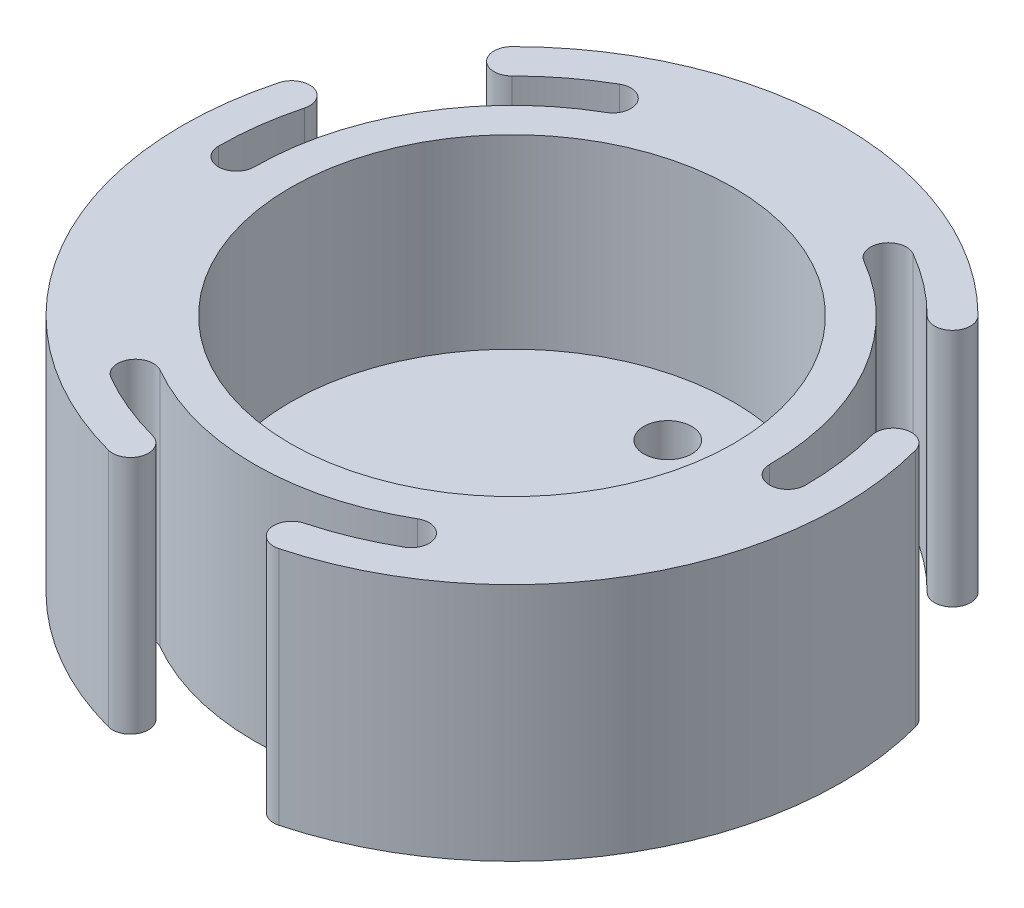
ISO-10303-21;
HEADER;
FILE_DESCRIPTION(('STEP AP214'),'2;1');
FILE_NAME('part.step','',(''),(''),'','','');
FILE_SCHEMA(('AUTOMOTIVE_DESIGN { 1 0 10303 214 1 1 1 1 }'));
ENDSEC;
DATA;
#1=APPLICATION_CONTEXT('core data for automotive mechanical design processes');
#2=APPLICATION_PROTOCOL_DEFINITION('international standard','automotive_design',2000,#1);
#3=PRODUCT_CONTEXT('',#1,'mechanical');
#4=PRODUCT('Part','Part','',(#3));
#5=PRODUCT_RELATED_PRODUCT_CATEGORY('part','',(#4));
#6=PRODUCT_DEFINITION_FORMATION('','',#4);
#7=PRODUCT_DEFINITION_CONTEXT('part definition',#1,'design');
#8=PRODUCT_DEFINITION('design','',#6,#7);
#9=PRODUCT_DEFINITION_SHAPE('','',#8);
#10=(LENGTH_UNIT() NAMED_UNIT(*) SI_UNIT(.MILLI.,.METRE.));
#11=(NAMED_UNIT(*) PLANE_ANGLE_UNIT() SI_UNIT($,.RADIAN.));
#12=(NAMED_UNIT(*) SI_UNIT($,.STERADIAN.) SOLID_ANGLE_UNIT());
#13=UNCERTAINTY_MEASURE_WITH_UNIT(LENGTH_MEASURE(1.E-05),#10,'distance_accuracy_value','');
#14=(GEOMETRIC_REPRESENTATION_CONTEXT(3) GLOBAL_UNCERTAINTY_ASSIGNED_CONTEXT((#13)) GLOBAL_UNIT_ASSIGNED_CONTEXT((#10,
#11,#12)) REPRESENTATION_CONTEXT('',''));
#15=CARTESIAN_POINT('',(0.,0.,0.));
#16=DIRECTION('',(0.,0.,1.));
#17=DIRECTION('',(1.,0.,0.));
#18=AXIS2_PLACEMENT_3D('',#15,#16,#17);
#19=CARTESIAN_POINT('',(0.,20.,0.));
#20=DIRECTION('',(0.,-1.,0.));
#21=DIRECTION('',(0.,0.,-1.));
#22=AXIS2_PLACEMENT_3D('',#19,#20,#21);
#23=CYLINDRICAL_SURFACE('',#22,18.5);
#24=CARTESIAN_POINT('',(0.,20.,0.));
#25=DIRECTION('',(0.,1.,0.));
#26=DIRECTION('',(0.,0.,1.));
#27=AXIS2_PLACEMENT_3D('',#24,#25,#26);
#28=CIRCLE('',#27,18.5);
#29=CARTESIAN_POINT('',(0.,20.,18.5));
#30=VERTEX_POINT('',#29);
#31=EDGE_CURVE('E11',#30,#30,#28,.T.);
#32=ORIENTED_EDGE('',*,*,#31,.T.);
#33=EDGE_LOOP('',(#32));
#34=FACE_BOUND('',#33,.T.);
#35=CARTESIAN_POINT('',(0.,4.5,0.));
#36=DIRECTION('',(0.,-1.,0.));
#37=DIRECTION('',(0.,0.,-1.));
#38=AXIS2_PLACEMENT_3D('',#35,#36,#37);
#39=CIRCLE('',#38,18.5);
#40=CARTESIAN_POINT('',(0.,4.5,-18.5));
#41=VERTEX_POINT('',#40);
#42=EDGE_CURVE('E284',#41,#41,#39,.T.);
#43=ORIENTED_EDGE('',*,*,#42,.T.);
#44=EDGE_LOOP('',(#43));
#45=FACE_BOUND('',#44,.T.);
#46=ADVANCED_FACE('F37',(#34,#45),#23,.F.);
#47=CARTESIAN_POINT('',(0.,20.,0.));
#48=DIRECTION('',(0.,1.,0.));
#49=DIRECTION('',(0.,0.,1.));
#50=AXIS2_PLACEMENT_3D('',#47,#48,#49);
#51=PLANE('',#50);
#52=CARTESIAN_POINT('',(-11.5000000000001,20.,19.918584287042));
#53=DIRECTION('',(0.,1.,0.));
#54=DIRECTION('',(0.,0.,1.));
#55=AXIS2_PLACEMENT_3D('',#52,#53,#54);
#56=CIRCLE('',#55,1.5);
#57=CARTESIAN_POINT('',(-10.7500000000001,20.,18.6195461813654));
#58=VERTEX_POINT('',#57);
#59=CARTESIAN_POINT('',(-12.2500000000001,20.,21.2176223927187));
#60=VERTEX_POINT('',#59);
#61=EDGE_CURVE('E129',#58,#60,#56,.T.);
#62=ORIENTED_EDGE('',*,*,#61,.F.);
#63=CARTESIAN_POINT('',(0.,20.,0.));
#64=DIRECTION('',(0.,-1.,0.));
#65=DIRECTION('',(0.,0.,1.));
#66=AXIS2_PLACEMENT_3D('',#63,#64,#65);
#67=CIRCLE('',#66,21.5);
#68=CARTESIAN_POINT('',(10.7499999999998,20.,18.6195461813655));
#69=VERTEX_POINT('',#68);
#70=EDGE_CURVE('E121',#69,#58,#67,.T.);
#71=ORIENTED_EDGE('',*,*,#70,.F.);
#72=CARTESIAN_POINT('',(11.4999999999998,20.,19.9185842870422));
#73=DIRECTION('',(0.,1.,0.));
#74=DIRECTION('',(0.,0.,1.));
#75=AXIS2_PLACEMENT_3D('',#72,#73,#74);
#76=CIRCLE('',#75,1.5);
#77=CARTESIAN_POINT('',(12.2499999999998,20.,21.2176223927189));
#78=VERTEX_POINT('',#77);
#79=EDGE_CURVE('E133',#78,#69,#76,.T.);
#80=ORIENTED_EDGE('',*,*,#79,.F.);
#81=CARTESIAN_POINT('',(0.,20.,0.));
#82=DIRECTION('',(0.,-1.,0.));
#83=DIRECTION('',(0.,0.,1.));
#84=AXIS2_PLACEMENT_3D('',#81,#82,#83);
#85=CIRCLE('',#84,24.5);
#86=CARTESIAN_POINT('',(6.34106660501176,20.,23.6651827440822));
#87=VERTEX_POINT('',#86);
#88=EDGE_CURVE('E233',#78,#87,#85,.T.);
#89=ORIENTED_EDGE('',*,*,#88,.T.);
#90=CARTESIAN_POINT('',(6.7292951726655,20.,25.1140714835158));
#91=DIRECTION('',(0.,1.,0.));
#92=DIRECTION('',(0.,0.,1.));
#93=AXIS2_PLACEMENT_3D('',#90,#91,#92);
#94=CIRCLE('',#93,1.5);
#95=CARTESIAN_POINT('',(7.11752374031928,20.,26.5629602229494));
#96=VERTEX_POINT('',#95);
#97=EDGE_CURVE('E201',#87,#96,#94,.T.);
#98=ORIENTED_EDGE('',*,*,#97,.T.);
#99=CARTESIAN_POINT('',(0.,20.,0.));
#100=DIRECTION('',(0.,1.,0.));
#101=DIRECTION('',(0.,0.,1.));
#102=AXIS2_PLACEMENT_3D('',#99,#100,#101);
#103=CIRCLE('',#102,27.5);
#104=CARTESIAN_POINT('',(26.5629602229494,20.,-7.11752374031937));
#105=VERTEX_POINT('',#104);
#106=EDGE_CURVE('E224',#96,#105,#103,.T.);
#107=ORIENTED_EDGE('',*,*,#106,.T.);
#108=CARTESIAN_POINT('',(25.1140714835158,20.,-6.72929517266559));
#109=DIRECTION('',(0.,1.,0.));
#110=DIRECTION('',(0.,0.,1.));
#111=AXIS2_PLACEMENT_3D('',#108,#109,#110);
#112=CIRCLE('',#111,1.5);
#113=CARTESIAN_POINT('',(23.6651827440822,20.,-6.34106660501185));
#114=VERTEX_POINT('',#113);
#115=EDGE_CURVE('E227',#105,#114,#112,.T.);
#116=ORIENTED_EDGE('',*,*,#115,.T.);
#117=CARTESIAN_POINT('',(24.5,20.,1.33219235306974E-13));
#118=VERTEX_POINT('',#117);
#119=EDGE_CURVE('E230',#114,#118,#85,.T.);
#120=ORIENTED_EDGE('',*,*,#119,.T.);
#121=CARTESIAN_POINT('',(23.,20.,1.25062955594302E-13));
#122=DIRECTION('',(0.,1.,0.));
#123=DIRECTION('',(0.,0.,1.));
#124=AXIS2_PLACEMENT_3D('',#121,#122,#123);
#125=CIRCLE('',#124,1.5);
#126=CARTESIAN_POINT('',(21.5,20.,1.158915114504E-13));
#127=VERTEX_POINT('',#126);
#128=EDGE_CURVE('E98',#127,#118,#125,.T.);
#129=ORIENTED_EDGE('',*,*,#128,.F.);
#130=CARTESIAN_POINT('',(0.,20.,0.));
#131=DIRECTION('',(0.,-1.,0.));
#132=DIRECTION('',(0.,0.,1.));
#133=AXIS2_PLACEMENT_3D('',#130,#131,#132);
#134=CIRCLE('',#133,21.5);
#135=CARTESIAN_POINT('',(10.7500000000002,20.,-18.6195461813653));
#136=VERTEX_POINT('',#135);
#137=EDGE_CURVE('E153',#136,#127,#134,.T.);
#138=ORIENTED_EDGE('',*,*,#137,.F.);
#139=CARTESIAN_POINT('',(11.5000000000002,20.,-19.918584287042));
#140=DIRECTION('',(0.,1.,0.));
#141=DIRECTION('',(0.,0.,1.));
#142=AXIS2_PLACEMENT_3D('',#139,#140,#141);
#143=CIRCLE('',#142,1.5);
#144=CARTESIAN_POINT('',(12.2500000000002,20.,-21.2176223927186));
#145=VERTEX_POINT('',#144);
#146=EDGE_CURVE('E102',#145,#136,#143,.T.);
#147=ORIENTED_EDGE('',*,*,#146,.F.);
#148=CARTESIAN_POINT('',(0.,20.,0.));
#149=DIRECTION('',(0.,-1.,0.));
#150=DIRECTION('',(0.,0.,1.));
#151=AXIS2_PLACEMENT_3D('',#148,#149,#150);
#152=CIRCLE('',#151,24.5);
#153=CARTESIAN_POINT('',(17.3241161390705,20.,-17.3241161390704));
#154=VERTEX_POINT('',#153);
#155=EDGE_CURVE('E192',#145,#154,#152,.T.);
#156=ORIENTED_EDGE('',*,*,#155,.T.);
#157=CARTESIAN_POINT('',(18.3847763108503,20.,-18.3847763108502));
#158=DIRECTION('',(0.,1.,0.));
#159=DIRECTION('',(0.,0.,1.));
#160=AXIS2_PLACEMENT_3D('',#157,#158,#159);
#161=CIRCLE('',#160,1.5);
#162=CARTESIAN_POINT('',(19.4454364826301,20.,-19.44543648263));
#163=VERTEX_POINT('',#162);
#164=EDGE_CURVE('E198',#154,#163,#161,.T.);
#165=ORIENTED_EDGE('',*,*,#164,.T.);
#166=CARTESIAN_POINT('',(0.,20.,0.));
#167=DIRECTION('',(0.,1.,0.));
#168=DIRECTION('',(0.,0.,1.));
#169=AXIS2_PLACEMENT_3D('',#166,#167,#168);
#170=CIRCLE('',#169,27.5);
#171=CARTESIAN_POINT('',(-19.4454364826301,20.,-19.44543648263));
#172=VERTEX_POINT('',#171);
#173=EDGE_CURVE('E195',#163,#172,#170,.T.);
#174=ORIENTED_EDGE('',*,*,#173,.T.);
#175=CARTESIAN_POINT('',(-18.3847763108503,20.,-18.3847763108502));
#176=DIRECTION('',(0.,1.,0.));
#177=DIRECTION('',(0.,0.,1.));
#178=AXIS2_PLACEMENT_3D('',#175,#176,#177);
#179=CIRCLE('',#178,1.5);
#180=CARTESIAN_POINT('',(-17.3241161390705,20.,-17.3241161390704));
#181=VERTEX_POINT('',#180);
#182=EDGE_CURVE('E193',#172,#181,#179,.T.);
#183=ORIENTED_EDGE('',*,*,#182,.T.);
#184=CARTESIAN_POINT('',(-12.2499999999999,20.,-21.2176223927188));
#185=VERTEX_POINT('',#184);
#186=EDGE_CURVE('E97',#181,#185,#152,.T.);
#187=ORIENTED_EDGE('',*,*,#186,.T.);
#188=CARTESIAN_POINT('',(-11.4999999999999,20.,-19.9185842870422));
#189=DIRECTION('',(0.,1.,0.));
#190=DIRECTION('',(0.,0.,1.));
#191=AXIS2_PLACEMENT_3D('',#188,#189,#190);
#192=CIRCLE('',#191,1.5);
#193=CARTESIAN_POINT('',(-10.7499999999999,20.,-18.6195461813655));
#194=VERTEX_POINT('',#193);
#195=EDGE_CURVE('E77',#194,#185,#192,.T.);
#196=ORIENTED_EDGE('',*,*,#195,.F.);
#197=CARTESIAN_POINT('',(0.,20.,0.));
#198=DIRECTION('',(0.,-1.,0.));
#199=DIRECTION('',(0.,0.,1.));
#200=AXIS2_PLACEMENT_3D('',#197,#198,#199);
#201=CIRCLE('',#200,21.5);
#202=CARTESIAN_POINT('',(-21.5,20.,-2.06291908745145E-13));
#203=VERTEX_POINT('',#202);
#204=EDGE_CURVE('E84',#203,#194,#201,.T.);
#205=ORIENTED_EDGE('',*,*,#204,.F.);
#206=CARTESIAN_POINT('',(-23.,20.,-2.21038701180133E-13));
#207=DIRECTION('',(0.,1.,0.));
#208=DIRECTION('',(0.,0.,1.));
#209=AXIS2_PLACEMENT_3D('',#206,#207,#208);
#210=CIRCLE('',#209,1.5);
#211=CARTESIAN_POINT('',(-24.5,20.,-2.65625032378703E-13));
#212=VERTEX_POINT('',#211);
#213=EDGE_CURVE('E89',#212,#203,#210,.T.);
#214=ORIENTED_EDGE('',*,*,#213,.F.);
#215=CARTESIAN_POINT('',(0.,20.,0.));
#216=DIRECTION('',(0.,-1.,0.));
#217=DIRECTION('',(0.,0.,1.));
#218=AXIS2_PLACEMENT_3D('',#215,#216,#217);
#219=CIRCLE('',#218,24.5);
#220=CARTESIAN_POINT('',(-23.6651827440822,20.,-6.34106660501178));
#221=VERTEX_POINT('',#220);
#222=EDGE_CURVE('E270',#212,#221,#219,.T.);
#223=ORIENTED_EDGE('',*,*,#222,.T.);
#224=CARTESIAN_POINT('',(-25.1140714835158,20.,-6.72929517266559));
#225=DIRECTION('',(0.,1.,0.));
#226=DIRECTION('',(0.,0.,1.));
#227=AXIS2_PLACEMENT_3D('',#224,#225,#226);
#228=CIRCLE('',#227,1.5);
#229=CARTESIAN_POINT('',(-26.5629602229494,20.,-7.11752374031937));
#230=VERTEX_POINT('',#229);
#231=EDGE_CURVE('E247',#221,#230,#228,.T.);
#232=ORIENTED_EDGE('',*,*,#231,.T.);
#233=CARTESIAN_POINT('',(0.,20.,0.));
#234=DIRECTION('',(0.,1.,0.));
#235=DIRECTION('',(0.,0.,1.));
#236=AXIS2_PLACEMENT_3D('',#233,#234,#235);
#237=CIRCLE('',#236,27.5);
#238=CARTESIAN_POINT('',(-7.11752374031927,20.,26.5629602229494));
#239=VERTEX_POINT('',#238);
#240=EDGE_CURVE('E261',#230,#239,#237,.T.);
#241=ORIENTED_EDGE('',*,*,#240,.T.);
#242=CARTESIAN_POINT('',(-6.7292951726655,20.,25.1140714835158));
#243=DIRECTION('',(0.,1.,0.));
#244=DIRECTION('',(0.,0.,1.));
#245=AXIS2_PLACEMENT_3D('',#242,#243,#244);
#246=CIRCLE('',#245,1.5);
#247=CARTESIAN_POINT('',(-6.34106660501165,20.,23.6651827440822));
#248=VERTEX_POINT('',#247);
#249=EDGE_CURVE('E264',#239,#248,#246,.T.);
#250=ORIENTED_EDGE('',*,*,#249,.T.);
#251=EDGE_CURVE('E267',#248,#60,#219,.T.);
#252=ORIENTED_EDGE('',*,*,#251,.T.);
#253=EDGE_LOOP('',(#62,#71,#80,#89,#98,#107,#116,#120,#129,#138,#147,#156,#165,#174,#183,#187,
#196,#205,#214,#223,#232,#241,#250,#252));
#254=FACE_BOUND('',#253,.T.);
#255=ORIENTED_EDGE('',*,*,#31,.F.);
#256=EDGE_LOOP('',(#255));
#257=FACE_BOUND('',#256,.T.);
#258=ADVANCED_FACE('F93',(#254,#257),#51,.T.);
#259=CARTESIAN_POINT('',(0.,0.,0.));
#260=DIRECTION('',(0.,1.,0.));
#261=DIRECTION('',(0.,0.,1.));
#262=AXIS2_PLACEMENT_3D('',#259,#260,#261);
#263=PLANE('',#262);
#264=CARTESIAN_POINT('',(0.,0.,-13.));
#265=DIRECTION('',(0.,1.,0.));
#266=DIRECTION('',(0.,0.,1.));
#267=AXIS2_PLACEMENT_3D('',#264,#265,#266);
#268=CIRCLE('',#267,2.);
#269=CARTESIAN_POINT('',(0.,0.,-11.));
#270=VERTEX_POINT('',#269);
#271=EDGE_CURVE('E287',#270,#270,#268,.F.);
#272=ORIENTED_EDGE('',*,*,#271,.F.);
#273=EDGE_LOOP('',(#272));
#274=FACE_BOUND('',#273,.T.);
#275=CARTESIAN_POINT('',(11.2583302491977,0.,6.5));
#276=DIRECTION('',(0.,1.,0.));
#277=DIRECTION('',(0.,0.,1.));
#278=AXIS2_PLACEMENT_3D('',#275,#276,#277);
#279=CIRCLE('',#278,2.);
#280=CARTESIAN_POINT('',(11.2583302491977,0.,8.5));
#281=VERTEX_POINT('',#280);
#282=EDGE_CURVE('E291',#281,#281,#279,.F.);
#283=ORIENTED_EDGE('',*,*,#282,.F.);
#284=EDGE_LOOP('',(#283));
#285=FACE_BOUND('',#284,.T.);
#286=CARTESIAN_POINT('',(-11.2583302491977,0.,6.50000000000001));
#287=DIRECTION('',(0.,1.,0.));
#288=DIRECTION('',(0.,0.,1.));
#289=AXIS2_PLACEMENT_3D('',#286,#287,#288);
#290=CIRCLE('',#289,2.);
#291=CARTESIAN_POINT('',(-11.2583302491977,0.,8.5));
#292=VERTEX_POINT('',#291);
#293=EDGE_CURVE('E292',#292,#292,#290,.F.);
#294=ORIENTED_EDGE('',*,*,#293,.F.);
#295=EDGE_LOOP('',(#294));
#296=FACE_BOUND('',#295,.T.);
#297=CARTESIAN_POINT('',(-23.,0.,-2.21038701180133E-13));
#298=DIRECTION('',(0.,1.,0.));
#299=DIRECTION('',(0.,0.,1.));
#300=AXIS2_PLACEMENT_3D('',#297,#298,#299);
#301=CIRCLE('',#300,1.5);
#302=CARTESIAN_POINT('',(-24.5,0.,-2.35454268648402E-13));
#303=VERTEX_POINT('',#302);
#304=CARTESIAN_POINT('',(-21.5,0.,-2.06291908745145E-13));
#305=VERTEX_POINT('',#304);
#306=EDGE_CURVE('E52',#303,#305,#301,.T.);
#307=ORIENTED_EDGE('',*,*,#306,.T.);
#308=CARTESIAN_POINT('',(0.,0.,0.));
#309=DIRECTION('',(0.,-1.,0.));
#310=DIRECTION('',(0.,0.,1.));
#311=AXIS2_PLACEMENT_3D('',#308,#309,#310);
#312=CIRCLE('',#311,21.5);
#313=CARTESIAN_POINT('',(-10.7499999999999,0.,-18.6195461813655));
#314=VERTEX_POINT('',#313);
#315=EDGE_CURVE('E105',#305,#314,#312,.T.);
#316=ORIENTED_EDGE('',*,*,#315,.T.);
#317=CARTESIAN_POINT('',(-11.4999999999999,0.,-19.9185842870422));
#318=DIRECTION('',(0.,1.,0.));
#319=DIRECTION('',(0.,0.,1.));
#320=AXIS2_PLACEMENT_3D('',#317,#318,#319);
#321=CIRCLE('',#320,1.5);
#322=CARTESIAN_POINT('',(-12.2499999999999,0.,-21.2176223927188));
#323=VERTEX_POINT('',#322);
#324=EDGE_CURVE('E79',#314,#323,#321,.T.);
#325=ORIENTED_EDGE('',*,*,#324,.T.);
#326=CARTESIAN_POINT('',(0.,0.,0.));
#327=DIRECTION('',(0.,1.,0.));
#328=DIRECTION('',(0.,0.,1.));
#329=AXIS2_PLACEMENT_3D('',#326,#327,#328);
#330=CIRCLE('',#329,24.5);
#331=CARTESIAN_POINT('',(-17.3241161390705,0.,-17.3241161390704));
#332=VERTEX_POINT('',#331);
#333=EDGE_CURVE('E207',#323,#332,#330,.T.);
#334=ORIENTED_EDGE('',*,*,#333,.T.);
#335=CARTESIAN_POINT('',(-18.3847763108503,0.,-18.3847763108502));
#336=DIRECTION('',(0.,1.,0.));
#337=DIRECTION('',(0.,0.,1.));
#338=AXIS2_PLACEMENT_3D('',#335,#336,#337);
#339=CIRCLE('',#338,1.5);
#340=CARTESIAN_POINT('',(-19.4454364826301,0.,-19.44543648263));
#341=VERTEX_POINT('',#340);
#342=EDGE_CURVE('E190',#332,#341,#339,.F.);
#343=ORIENTED_EDGE('',*,*,#342,.T.);
#344=CARTESIAN_POINT('',(0.,0.,0.));
#345=DIRECTION('',(0.,1.,0.));
#346=DIRECTION('',(0.,0.,1.));
#347=AXIS2_PLACEMENT_3D('',#344,#345,#346);
#348=CIRCLE('',#347,27.5);
#349=CARTESIAN_POINT('',(19.4454364826301,0.,-19.44543648263));
#350=VERTEX_POINT('',#349);
#351=EDGE_CURVE('E142',#341,#350,#348,.F.);
#352=ORIENTED_EDGE('',*,*,#351,.T.);
#353=CARTESIAN_POINT('',(18.3847763108503,0.,-18.3847763108502));
#354=DIRECTION('',(0.,1.,0.));
#355=DIRECTION('',(0.,0.,1.));
#356=AXIS2_PLACEMENT_3D('',#353,#354,#355);
#357=CIRCLE('',#356,1.5);
#358=CARTESIAN_POINT('',(17.3241161390705,0.,-17.3241161390704));
#359=VERTEX_POINT('',#358);
#360=EDGE_CURVE('E177',#350,#359,#357,.F.);
#361=ORIENTED_EDGE('',*,*,#360,.T.);
#362=CARTESIAN_POINT('',(12.2500000000002,0.,-21.2176223927186));
#363=VERTEX_POINT('',#362);
#364=EDGE_CURVE('E204',#359,#363,#330,.T.);
#365=ORIENTED_EDGE('',*,*,#364,.T.);
#366=CARTESIAN_POINT('',(11.5000000000002,0.,-19.918584287042));
#367=DIRECTION('',(0.,1.,0.));
#368=DIRECTION('',(0.,0.,1.));
#369=AXIS2_PLACEMENT_3D('',#366,#367,#368);
#370=CIRCLE('',#369,1.5);
#371=CARTESIAN_POINT('',(10.7500000000002,0.,-18.6195461813653));
#372=VERTEX_POINT('',#371);
#373=EDGE_CURVE('E154',#363,#372,#370,.T.);
#374=ORIENTED_EDGE('',*,*,#373,.T.);
#375=CARTESIAN_POINT('',(0.,0.,0.));
#376=DIRECTION('',(0.,-1.,0.));
#377=DIRECTION('',(0.,0.,1.));
#378=AXIS2_PLACEMENT_3D('',#375,#376,#377);
#379=CIRCLE('',#378,21.5);
#380=CARTESIAN_POINT('',(21.5,0.,1.158915114504E-13));
#381=VERTEX_POINT('',#380);
#382=EDGE_CURVE('E157',#372,#381,#379,.T.);
#383=ORIENTED_EDGE('',*,*,#382,.T.);
#384=CARTESIAN_POINT('',(23.,0.,1.25062955594302E-13));
#385=DIRECTION('',(0.,1.,0.));
#386=DIRECTION('',(0.,0.,1.));
#387=AXIS2_PLACEMENT_3D('',#384,#385,#386);
#388=CIRCLE('',#387,1.5);
#389=CARTESIAN_POINT('',(24.5,0.,1.33219235306974E-13));
#390=VERTEX_POINT('',#389);
#391=EDGE_CURVE('E150',#381,#390,#388,.T.);
#392=ORIENTED_EDGE('',*,*,#391,.T.);
#393=CARTESIAN_POINT('',(0.,0.,0.));
#394=DIRECTION('',(0.,1.,0.));
#395=DIRECTION('',(0.,0.,1.));
#396=AXIS2_PLACEMENT_3D('',#393,#394,#395);
#397=CIRCLE('',#396,24.5);
#398=CARTESIAN_POINT('',(23.6651827440822,0.,-6.34106660501185));
#399=VERTEX_POINT('',#398);
#400=EDGE_CURVE('E217',#390,#399,#397,.T.);
#401=ORIENTED_EDGE('',*,*,#400,.T.);
#402=CARTESIAN_POINT('',(25.1140714835158,0.,-6.72929517266559));
#403=DIRECTION('',(0.,1.,0.));
#404=DIRECTION('',(0.,0.,1.));
#405=AXIS2_PLACEMENT_3D('',#402,#403,#404);
#406=CIRCLE('',#405,1.5);
#407=CARTESIAN_POINT('',(26.5629602229494,0.,-7.11752374031937));
#408=VERTEX_POINT('',#407);
#409=EDGE_CURVE('E210',#399,#408,#406,.F.);
#410=ORIENTED_EDGE('',*,*,#409,.T.);
#411=CARTESIAN_POINT('',(0.,0.,0.));
#412=DIRECTION('',(0.,1.,0.));
#413=DIRECTION('',(0.,0.,1.));
#414=AXIS2_PLACEMENT_3D('',#411,#412,#413);
#415=CIRCLE('',#414,27.5);
#416=CARTESIAN_POINT('',(7.11752374031928,0.,26.5629602229494));
#417=VERTEX_POINT('',#416);
#418=EDGE_CURVE('E221',#408,#417,#415,.F.);
#419=ORIENTED_EDGE('',*,*,#418,.T.);
#420=CARTESIAN_POINT('',(6.7292951726655,0.,25.1140714835158));
#421=DIRECTION('',(0.,1.,0.));
#422=DIRECTION('',(0.,0.,1.));
#423=AXIS2_PLACEMENT_3D('',#420,#421,#422);
#424=CIRCLE('',#423,1.5);
#425=CARTESIAN_POINT('',(6.34106660501176,0.,23.6651827440822));
#426=VERTEX_POINT('',#425);
#427=EDGE_CURVE('E218',#417,#426,#424,.F.);
#428=ORIENTED_EDGE('',*,*,#427,.T.);
#429=CARTESIAN_POINT('',(12.2499999999998,0.,21.2176223927189));
#430=VERTEX_POINT('',#429);
#431=EDGE_CURVE('E214',#426,#430,#397,.T.);
#432=ORIENTED_EDGE('',*,*,#431,.T.);
#433=CARTESIAN_POINT('',(11.4999999999998,0.,19.9185842870422));
#434=DIRECTION('',(0.,1.,0.));
#435=DIRECTION('',(0.,0.,1.));
#436=AXIS2_PLACEMENT_3D('',#433,#434,#435);
#437=CIRCLE('',#436,1.5);
#438=CARTESIAN_POINT('',(10.7499999999998,0.,18.6195461813655));
#439=VERTEX_POINT('',#438);
#440=EDGE_CURVE('E122',#430,#439,#437,.T.);
#441=ORIENTED_EDGE('',*,*,#440,.T.);
#442=CARTESIAN_POINT('',(0.,0.,0.));
#443=DIRECTION('',(0.,-1.,0.));
#444=DIRECTION('',(0.,0.,1.));
#445=AXIS2_PLACEMENT_3D('',#442,#443,#444);
#446=CIRCLE('',#445,21.5);
#447=CARTESIAN_POINT('',(-10.7500000000001,0.,18.6195461813654));
#448=VERTEX_POINT('',#447);
#449=EDGE_CURVE('E125',#439,#448,#446,.T.);
#450=ORIENTED_EDGE('',*,*,#449,.T.);
#451=CARTESIAN_POINT('',(-11.5000000000001,0.,19.918584287042));
#452=DIRECTION('',(0.,1.,0.));
#453=DIRECTION('',(0.,0.,1.));
#454=AXIS2_PLACEMENT_3D('',#451,#452,#453);
#455=CIRCLE('',#454,1.5);
#456=CARTESIAN_POINT('',(-12.2500000000001,0.,21.2176223927187));
#457=VERTEX_POINT('',#456);
#458=EDGE_CURVE('E118',#448,#457,#455,.T.);
#459=ORIENTED_EDGE('',*,*,#458,.T.);
#460=CARTESIAN_POINT('',(0.,0.,0.));
#461=DIRECTION('',(0.,1.,0.));
#462=DIRECTION('',(0.,0.,1.));
#463=AXIS2_PLACEMENT_3D('',#460,#461,#462);
#464=CIRCLE('',#463,24.5);
#465=CARTESIAN_POINT('',(-6.34106660501165,0.,23.6651827440822));
#466=VERTEX_POINT('',#465);
#467=EDGE_CURVE('E254',#457,#466,#464,.T.);
#468=ORIENTED_EDGE('',*,*,#467,.T.);
#469=CARTESIAN_POINT('',(-6.7292951726655,0.,25.1140714835158));
#470=DIRECTION('',(0.,1.,0.));
#471=DIRECTION('',(0.,0.,1.));
#472=AXIS2_PLACEMENT_3D('',#469,#470,#471);
#473=CIRCLE('',#472,1.5);
#474=CARTESIAN_POINT('',(-7.11752374031927,0.,26.5629602229494));
#475=VERTEX_POINT('',#474);
#476=EDGE_CURVE('E248',#466,#475,#473,.F.);
#477=ORIENTED_EDGE('',*,*,#476,.T.);
#478=CARTESIAN_POINT('',(0.,0.,0.));
#479=DIRECTION('',(0.,1.,0.));
#480=DIRECTION('',(0.,0.,1.));
#481=AXIS2_PLACEMENT_3D('',#478,#479,#480);
#482=CIRCLE('',#481,27.5);
#483=CARTESIAN_POINT('',(-26.5629602229494,0.,-7.11752374031936));
#484=VERTEX_POINT('',#483);
#485=EDGE_CURVE('E258',#475,#484,#482,.F.);
#486=ORIENTED_EDGE('',*,*,#485,.T.);
#487=CARTESIAN_POINT('',(-25.1140714835158,0.,-6.72929517266559));
#488=DIRECTION('',(0.,1.,0.));
#489=DIRECTION('',(0.,0.,1.));
#490=AXIS2_PLACEMENT_3D('',#487,#488,#489);
#491=CIRCLE('',#490,1.5);
#492=CARTESIAN_POINT('',(-23.6651827440822,0.,-6.34106660501178));
#493=VERTEX_POINT('',#492);
#494=EDGE_CURVE('E255',#484,#493,#491,.F.);
#495=ORIENTED_EDGE('',*,*,#494,.T.);
#496=EDGE_CURVE('E252',#493,#303,#464,.T.);
#497=ORIENTED_EDGE('',*,*,#496,.T.);
#498=EDGE_LOOP('',(#307,#316,#325,#334,#343,#352,#361,#365,#374,#383,#392,#401,#410,#419,#428,
#432,#441,#450,#459,#468,#477,#486,#495,#497));
#499=FACE_BOUND('',#498,.T.);
#500=ADVANCED_FACE('F39',(#274,#285,#296,#499),#263,.F.);
#501=CARTESIAN_POINT('',(-11.4999999999999,0.,-19.9185842870422));
#502=DIRECTION('',(0.,1.,0.));
#503=DIRECTION('',(0.,0.,1.));
#504=AXIS2_PLACEMENT_3D('',#501,#502,#503);
#505=CYLINDRICAL_SURFACE('',#504,1.5);
#506=ORIENTED_EDGE('',*,*,#195,.T.);
#507=DIRECTION('',(0.,1.,0.));
#508=VECTOR('',#507,1.);
#509=CARTESIAN_POINT('',(-12.2499999999999,0.,-21.2176223927188));
#510=LINE('',#509,#508);
#511=EDGE_CURVE('E110',#323,#185,#510,.T.);
#512=ORIENTED_EDGE('',*,*,#511,.F.);
#513=ORIENTED_EDGE('',*,*,#324,.F.);
#514=DIRECTION('',(0.,1.,0.));
#515=VECTOR('',#514,1.);
#516=CARTESIAN_POINT('',(-10.7499999999999,0.,-18.6195461813655));
#517=LINE('',#516,#515);
#518=EDGE_CURVE('E45',#314,#194,#517,.T.);
#519=ORIENTED_EDGE('',*,*,#518,.T.);
#520=EDGE_LOOP('',(#506,#512,#513,#519));
#521=FACE_BOUND('',#520,.T.);
#522=ADVANCED_FACE('F73',(#521),#505,.F.);
#523=CARTESIAN_POINT('',(0.,0.,0.));
#524=DIRECTION('',(0.,1.,0.));
#525=DIRECTION('',(0.,0.,1.));
#526=AXIS2_PLACEMENT_3D('',#523,#524,#525);
#527=CYLINDRICAL_SURFACE('',#526,21.5);
#528=DIRECTION('',(0.,1.,0.));
#529=VECTOR('',#528,1.);
#530=CARTESIAN_POINT('',(-21.5,0.,-2.06291908745145E-13));
#531=LINE('',#530,#529);
#532=EDGE_CURVE('E81',#305,#203,#531,.T.);
#533=ORIENTED_EDGE('',*,*,#532,.T.);
#534=ORIENTED_EDGE('',*,*,#204,.T.);
#535=ORIENTED_EDGE('',*,*,#518,.F.);
#536=ORIENTED_EDGE('',*,*,#315,.F.);
#537=EDGE_LOOP('',(#533,#534,#535,#536));
#538=FACE_BOUND('',#537,.T.);
#539=ADVANCED_FACE('F85',(#538),#527,.T.);
#540=CARTESIAN_POINT('',(-23.,0.,-2.21038701180133E-13));
#541=DIRECTION('',(0.,1.,0.));
#542=DIRECTION('',(0.,0.,1.));
#543=AXIS2_PLACEMENT_3D('',#540,#541,#542);
#544=CYLINDRICAL_SURFACE('',#543,1.5);
#545=ORIENTED_EDGE('',*,*,#213,.T.);
#546=ORIENTED_EDGE('',*,*,#532,.F.);
#547=ORIENTED_EDGE('',*,*,#306,.F.);
#548=DIRECTION('',(0.,1.,0.));
#549=VECTOR('',#548,1.);
#550=CARTESIAN_POINT('',(-24.5,0.,-2.65625032378703E-13));
#551=LINE('',#550,#549);
#552=EDGE_CURVE('E109',#303,#212,#551,.T.);
#553=ORIENTED_EDGE('',*,*,#552,.T.);
#554=EDGE_LOOP('',(#545,#546,#547,#553));
#555=FACE_BOUND('',#554,.T.);
#556=ADVANCED_FACE('F330',(#555),#544,.F.);
#557=CARTESIAN_POINT('',(23.,0.,1.25062955594302E-13));
#558=DIRECTION('',(0.,1.,0.));
#559=DIRECTION('',(0.,0.,1.));
#560=AXIS2_PLACEMENT_3D('',#557,#558,#559);
#561=CYLINDRICAL_SURFACE('',#560,1.5);
#562=ORIENTED_EDGE('',*,*,#128,.T.);
#563=DIRECTION('',(0.,1.,0.));
#564=VECTOR('',#563,1.);
#565=CARTESIAN_POINT('',(24.5,0.,1.21182234383547E-13));
#566=LINE('',#565,#564);
#567=EDGE_CURVE('E159',#390,#118,#566,.T.);
#568=ORIENTED_EDGE('',*,*,#567,.F.);
#569=ORIENTED_EDGE('',*,*,#391,.F.);
#570=DIRECTION('',(0.,1.,0.));
#571=VECTOR('',#570,1.);
#572=CARTESIAN_POINT('',(21.5,0.,1.158915114504E-13));
#573=LINE('',#572,#571);
#574=EDGE_CURVE('E132',#381,#127,#573,.T.);
#575=ORIENTED_EDGE('',*,*,#574,.T.);
#576=EDGE_LOOP('',(#562,#568,#569,#575));
#577=FACE_BOUND('',#576,.T.);
#578=ADVANCED_FACE('F333',(#577),#561,.F.);
#579=CARTESIAN_POINT('',(0.,0.,0.));
#580=DIRECTION('',(0.,1.,0.));
#581=DIRECTION('',(0.,0.,1.));
#582=AXIS2_PLACEMENT_3D('',#579,#580,#581);
#583=CYLINDRICAL_SURFACE('',#582,21.5);
#584=DIRECTION('',(0.,1.,0.));
#585=VECTOR('',#584,1.);
#586=CARTESIAN_POINT('',(10.7500000000002,0.,-18.6195461813653));
#587=LINE('',#586,#585);
#588=EDGE_CURVE('E167',#372,#136,#587,.T.);
#589=ORIENTED_EDGE('',*,*,#588,.T.);
#590=ORIENTED_EDGE('',*,*,#137,.T.);
#591=ORIENTED_EDGE('',*,*,#574,.F.);
#592=ORIENTED_EDGE('',*,*,#382,.F.);
#593=EDGE_LOOP('',(#589,#590,#591,#592));
#594=FACE_BOUND('',#593,.T.);
#595=ADVANCED_FACE('F350',(#594),#583,.T.);
#596=CARTESIAN_POINT('',(11.5000000000002,0.,-19.918584287042));
#597=DIRECTION('',(0.,1.,0.));
#598=DIRECTION('',(0.,0.,1.));
#599=AXIS2_PLACEMENT_3D('',#596,#597,#598);
#600=CYLINDRICAL_SURFACE('',#599,1.5);
#601=ORIENTED_EDGE('',*,*,#146,.T.);
#602=ORIENTED_EDGE('',*,*,#588,.F.);
#603=ORIENTED_EDGE('',*,*,#373,.F.);
#604=DIRECTION('',(0.,1.,0.));
#605=VECTOR('',#604,1.);
#606=CARTESIAN_POINT('',(12.2500000000002,0.,-21.2176223927186));
#607=LINE('',#606,#605);
#608=EDGE_CURVE('E170',#363,#145,#607,.T.);
#609=ORIENTED_EDGE('',*,*,#608,.T.);
#610=EDGE_LOOP('',(#601,#602,#603,#609));
#611=FACE_BOUND('',#610,.T.);
#612=ADVANCED_FACE('F348',(#611),#600,.F.);
#613=CARTESIAN_POINT('',(-11.5000000000001,0.,19.918584287042));
#614=DIRECTION('',(0.,1.,0.));
#615=DIRECTION('',(0.,0.,1.));
#616=AXIS2_PLACEMENT_3D('',#613,#614,#615);
#617=CYLINDRICAL_SURFACE('',#616,1.5);
#618=ORIENTED_EDGE('',*,*,#61,.T.);
#619=DIRECTION('',(0.,1.,0.));
#620=VECTOR('',#619,1.);
#621=CARTESIAN_POINT('',(-12.2500000000001,0.,21.2176223927187));
#622=LINE('',#621,#620);
#623=EDGE_CURVE('E128',#457,#60,#622,.T.);
#624=ORIENTED_EDGE('',*,*,#623,.F.);
#625=ORIENTED_EDGE('',*,*,#458,.F.);
#626=DIRECTION('',(0.,1.,0.));
#627=VECTOR('',#626,1.);
#628=CARTESIAN_POINT('',(-10.7500000000001,0.,18.6195461813654));
#629=LINE('',#628,#627);
#630=EDGE_CURVE('E138',#448,#58,#629,.T.);
#631=ORIENTED_EDGE('',*,*,#630,.T.);
#632=EDGE_LOOP('',(#618,#624,#625,#631));
#633=FACE_BOUND('',#632,.T.);
#634=ADVANCED_FACE('F340',(#633),#617,.F.);
#635=CARTESIAN_POINT('',(0.,0.,0.));
#636=DIRECTION('',(0.,1.,0.));
#637=DIRECTION('',(0.,0.,1.));
#638=AXIS2_PLACEMENT_3D('',#635,#636,#637);
#639=CYLINDRICAL_SURFACE('',#638,21.5);
#640=DIRECTION('',(0.,1.,0.));
#641=VECTOR('',#640,1.);
#642=CARTESIAN_POINT('',(10.7499999999998,0.,18.6195461813655));
#643=LINE('',#642,#641);
#644=EDGE_CURVE('E141',#439,#69,#643,.T.);
#645=ORIENTED_EDGE('',*,*,#644,.T.);
#646=ORIENTED_EDGE('',*,*,#70,.T.);
#647=ORIENTED_EDGE('',*,*,#630,.F.);
#648=ORIENTED_EDGE('',*,*,#449,.F.);
#649=EDGE_LOOP('',(#645,#646,#647,#648));
#650=FACE_BOUND('',#649,.T.);
#651=ADVANCED_FACE('F336',(#650),#639,.T.);
#652=CARTESIAN_POINT('',(11.4999999999998,0.,19.9185842870422));
#653=DIRECTION('',(0.,1.,0.));
#654=DIRECTION('',(0.,0.,1.));
#655=AXIS2_PLACEMENT_3D('',#652,#653,#654);
#656=CYLINDRICAL_SURFACE('',#655,1.5);
#657=ORIENTED_EDGE('',*,*,#79,.T.);
#658=ORIENTED_EDGE('',*,*,#644,.F.);
#659=ORIENTED_EDGE('',*,*,#440,.F.);
#660=DIRECTION('',(0.,1.,0.));
#661=VECTOR('',#660,1.);
#662=CARTESIAN_POINT('',(12.2499999999998,0.,21.2176223927189));
#663=LINE('',#662,#661);
#664=EDGE_CURVE('E145',#430,#78,#663,.T.);
#665=ORIENTED_EDGE('',*,*,#664,.T.);
#666=EDGE_LOOP('',(#657,#658,#659,#665));
#667=FACE_BOUND('',#666,.T.);
#668=ADVANCED_FACE('F339',(#667),#656,.F.);
#669=CARTESIAN_POINT('',(0.,-41.3526842350452,0.));
#670=DIRECTION('',(0.,1.,0.));
#671=DIRECTION('',(0.,0.,1.));
#672=AXIS2_PLACEMENT_3D('',#669,#670,#671);
#673=CYLINDRICAL_SURFACE('',#672,24.5);
#674=ORIENTED_EDGE('',*,*,#608,.F.);
#675=ORIENTED_EDGE('',*,*,#364,.F.);
#676=DIRECTION('',(0.,1.,0.));
#677=VECTOR('',#676,1.);
#678=CARTESIAN_POINT('',(17.3241161390705,-41.3526842350452,-17.3241161390704));
#679=LINE('',#678,#677);
#680=EDGE_CURVE('E187',#359,#154,#679,.T.);
#681=ORIENTED_EDGE('',*,*,#680,.T.);
#682=ORIENTED_EDGE('',*,*,#155,.F.);
#683=EDGE_LOOP('',(#674,#675,#681,#682));
#684=FACE_BOUND('',#683,.T.);
#685=ADVANCED_FACE('F344',(#684),#673,.F.);
#686=CARTESIAN_POINT('',(18.3847763108503,-41.3526842350452,-18.3847763108502));
#687=DIRECTION('',(0.,1.,0.));
#688=DIRECTION('',(0.,0.,1.));
#689=AXIS2_PLACEMENT_3D('',#686,#687,#688);
#690=CYLINDRICAL_SURFACE('',#689,1.5);
#691=ORIENTED_EDGE('',*,*,#360,.F.);
#692=DIRECTION('',(0.,1.,0.));
#693=VECTOR('',#692,1.);
#694=CARTESIAN_POINT('',(19.4454364826301,-41.3526842350452,-19.44543648263));
#695=LINE('',#694,#693);
#696=EDGE_CURVE('E178',#350,#163,#695,.T.);
#697=ORIENTED_EDGE('',*,*,#696,.T.);
#698=ORIENTED_EDGE('',*,*,#164,.F.);
#699=ORIENTED_EDGE('',*,*,#680,.F.);
#700=EDGE_LOOP('',(#691,#697,#698,#699));
#701=FACE_BOUND('',#700,.T.);
#702=ADVANCED_FACE('F360',(#701),#690,.T.);
#703=ORIENTED_EDGE('',*,*,#333,.F.);
#704=ORIENTED_EDGE('',*,*,#511,.T.);
#705=ORIENTED_EDGE('',*,*,#186,.F.);
#706=DIRECTION('',(0.,1.,0.));
#707=VECTOR('',#706,1.);
#708=CARTESIAN_POINT('',(-17.3241161390705,-41.3526842350452,-17.3241161390704));
#709=LINE('',#708,#707);
#710=EDGE_CURVE('E184',#332,#181,#709,.T.);
#711=ORIENTED_EDGE('',*,*,#710,.F.);
#712=EDGE_LOOP('',(#703,#704,#705,#711));
#713=FACE_BOUND('',#712,.T.);
#714=ADVANCED_FACE('F363',(#713),#673,.F.);
#715=CARTESIAN_POINT('',(-18.3847763108503,-41.3526842350452,-18.3847763108502));
#716=DIRECTION('',(0.,1.,0.));
#717=DIRECTION('',(0.,0.,1.));
#718=AXIS2_PLACEMENT_3D('',#715,#716,#717);
#719=CYLINDRICAL_SURFACE('',#718,1.5);
#720=ORIENTED_EDGE('',*,*,#342,.F.);
#721=ORIENTED_EDGE('',*,*,#710,.T.);
#722=ORIENTED_EDGE('',*,*,#182,.F.);
#723=DIRECTION('',(0.,1.,0.));
#724=VECTOR('',#723,1.);
#725=CARTESIAN_POINT('',(-19.4454364826301,-41.3526842350452,-19.44543648263));
#726=LINE('',#725,#724);
#727=EDGE_CURVE('E181',#341,#172,#726,.T.);
#728=ORIENTED_EDGE('',*,*,#727,.F.);
#729=EDGE_LOOP('',(#720,#721,#722,#728));
#730=FACE_BOUND('',#729,.T.);
#731=ADVANCED_FACE('F369',(#730),#719,.T.);
#732=CARTESIAN_POINT('',(0.,-41.3526842350452,0.));
#733=DIRECTION('',(0.,1.,0.));
#734=DIRECTION('',(0.,0.,1.));
#735=AXIS2_PLACEMENT_3D('',#732,#733,#734);
#736=CYLINDRICAL_SURFACE('',#735,27.5);
#737=ORIENTED_EDGE('',*,*,#351,.F.);
#738=ORIENTED_EDGE('',*,*,#727,.T.);
#739=ORIENTED_EDGE('',*,*,#173,.F.);
#740=ORIENTED_EDGE('',*,*,#696,.F.);
#741=EDGE_LOOP('',(#737,#738,#739,#740));
#742=FACE_BOUND('',#741,.T.);
#743=ADVANCED_FACE('F365',(#742),#736,.T.);
#744=CARTESIAN_POINT('',(0.,-41.3526842350452,0.));
#745=DIRECTION('',(0.,1.,0.));
#746=DIRECTION('',(0.,0.,1.));
#747=AXIS2_PLACEMENT_3D('',#744,#745,#746);
#748=CYLINDRICAL_SURFACE('',#747,24.5);
#749=ORIENTED_EDGE('',*,*,#664,.F.);
#750=ORIENTED_EDGE('',*,*,#431,.F.);
#751=DIRECTION('',(0.,1.,0.));
#752=VECTOR('',#751,1.);
#753=CARTESIAN_POINT('',(6.34106660501176,-41.3526842350452,23.6651827440822));
#754=LINE('',#753,#752);
#755=EDGE_CURVE('E213',#426,#87,#754,.T.);
#756=ORIENTED_EDGE('',*,*,#755,.T.);
#757=ORIENTED_EDGE('',*,*,#88,.F.);
#758=EDGE_LOOP('',(#749,#750,#756,#757));
#759=FACE_BOUND('',#758,.T.);
#760=ADVANCED_FACE('F368',(#759),#748,.F.);
#761=CARTESIAN_POINT('',(6.7292951726655,-41.3526842350452,25.1140714835158));
#762=DIRECTION('',(0.,1.,0.));
#763=DIRECTION('',(0.,0.,1.));
#764=AXIS2_PLACEMENT_3D('',#761,#762,#763);
#765=CYLINDRICAL_SURFACE('',#764,1.5);
#766=ORIENTED_EDGE('',*,*,#427,.F.);
#767=DIRECTION('',(0.,1.,0.));
#768=VECTOR('',#767,1.);
#769=CARTESIAN_POINT('',(7.11752374031928,-41.3526842350452,26.5629602229494));
#770=LINE('',#769,#768);
#771=EDGE_CURVE('E242',#417,#96,#770,.T.);
#772=ORIENTED_EDGE('',*,*,#771,.T.);
#773=ORIENTED_EDGE('',*,*,#97,.F.);
#774=ORIENTED_EDGE('',*,*,#755,.F.);
#775=EDGE_LOOP('',(#766,#772,#773,#774));
#776=FACE_BOUND('',#775,.T.);
#777=ADVANCED_FACE('F380',(#776),#765,.T.);
#778=ORIENTED_EDGE('',*,*,#400,.F.);
#779=ORIENTED_EDGE('',*,*,#567,.T.);
#780=ORIENTED_EDGE('',*,*,#119,.F.);
#781=DIRECTION('',(0.,1.,0.));
#782=VECTOR('',#781,1.);
#783=CARTESIAN_POINT('',(23.6651827440822,-41.3526842350452,-6.34106660501185));
#784=LINE('',#783,#782);
#785=EDGE_CURVE('E236',#399,#114,#784,.T.);
#786=ORIENTED_EDGE('',*,*,#785,.F.);
#787=EDGE_LOOP('',(#778,#779,#780,#786));
#788=FACE_BOUND('',#787,.T.);
#789=ADVANCED_FACE('F376',(#788),#748,.F.);
#790=CARTESIAN_POINT('',(25.1140714835158,-41.3526842350452,-6.72929517266559));
#791=DIRECTION('',(0.,1.,0.));
#792=DIRECTION('',(0.,0.,1.));
#793=AXIS2_PLACEMENT_3D('',#790,#791,#792);
#794=CYLINDRICAL_SURFACE('',#793,1.5);
#795=ORIENTED_EDGE('',*,*,#409,.F.);
#796=ORIENTED_EDGE('',*,*,#785,.T.);
#797=ORIENTED_EDGE('',*,*,#115,.F.);
#798=DIRECTION('',(0.,1.,0.));
#799=VECTOR('',#798,1.);
#800=CARTESIAN_POINT('',(26.5629602229494,-41.3526842350452,-7.11752374031937));
#801=LINE('',#800,#799);
#802=EDGE_CURVE('E239',#408,#105,#801,.T.);
#803=ORIENTED_EDGE('',*,*,#802,.F.);
#804=EDGE_LOOP('',(#795,#796,#797,#803));
#805=FACE_BOUND('',#804,.T.);
#806=ADVANCED_FACE('F379',(#805),#794,.T.);
#807=CARTESIAN_POINT('',(0.,-41.3526842350452,0.));
#808=DIRECTION('',(0.,1.,0.));
#809=DIRECTION('',(0.,0.,1.));
#810=AXIS2_PLACEMENT_3D('',#807,#808,#809);
#811=CYLINDRICAL_SURFACE('',#810,27.5);
#812=ORIENTED_EDGE('',*,*,#418,.F.);
#813=ORIENTED_EDGE('',*,*,#802,.T.);
#814=ORIENTED_EDGE('',*,*,#106,.F.);
#815=ORIENTED_EDGE('',*,*,#771,.F.);
#816=EDGE_LOOP('',(#812,#813,#814,#815));
#817=FACE_BOUND('',#816,.T.);
#818=ADVANCED_FACE('F384',(#817),#811,.T.);
#819=CARTESIAN_POINT('',(0.,-41.3526842350452,0.));
#820=DIRECTION('',(0.,1.,0.));
#821=DIRECTION('',(0.,0.,1.));
#822=AXIS2_PLACEMENT_3D('',#819,#820,#821);
#823=CYLINDRICAL_SURFACE('',#822,24.5);
#824=ORIENTED_EDGE('',*,*,#552,.F.);
#825=ORIENTED_EDGE('',*,*,#496,.F.);
#826=DIRECTION('',(0.,1.,0.));
#827=VECTOR('',#826,1.);
#828=CARTESIAN_POINT('',(-23.6651827440822,-41.3526842350452,-6.34106660501178));
#829=LINE('',#828,#827);
#830=EDGE_CURVE('E251',#493,#221,#829,.T.);
#831=ORIENTED_EDGE('',*,*,#830,.T.);
#832=ORIENTED_EDGE('',*,*,#222,.F.);
#833=EDGE_LOOP('',(#824,#825,#831,#832));
#834=FACE_BOUND('',#833,.T.);
#835=ADVANCED_FACE('F388',(#834),#823,.F.);
#836=CARTESIAN_POINT('',(-25.1140714835158,-41.3526842350452,-6.72929517266559));
#837=DIRECTION('',(0.,1.,0.));
#838=DIRECTION('',(0.,0.,1.));
#839=AXIS2_PLACEMENT_3D('',#836,#837,#838);
#840=CYLINDRICAL_SURFACE('',#839,1.5);
#841=ORIENTED_EDGE('',*,*,#494,.F.);
#842=DIRECTION('',(0.,1.,0.));
#843=VECTOR('',#842,1.);
#844=CARTESIAN_POINT('',(-26.5629602229494,-41.3526842350452,-7.11752374031937));
#845=LINE('',#844,#843);
#846=EDGE_CURVE('E279',#484,#230,#845,.T.);
#847=ORIENTED_EDGE('',*,*,#846,.T.);
#848=ORIENTED_EDGE('',*,*,#231,.F.);
#849=ORIENTED_EDGE('',*,*,#830,.F.);
#850=EDGE_LOOP('',(#841,#847,#848,#849));
#851=FACE_BOUND('',#850,.T.);
#852=ADVANCED_FACE('F397',(#851),#840,.T.);
#853=ORIENTED_EDGE('',*,*,#467,.F.);
#854=ORIENTED_EDGE('',*,*,#623,.T.);
#855=ORIENTED_EDGE('',*,*,#251,.F.);
#856=DIRECTION('',(0.,1.,0.));
#857=VECTOR('',#856,1.);
#858=CARTESIAN_POINT('',(-6.34106660501165,-41.3526842350452,23.6651827440822));
#859=LINE('',#858,#857);
#860=EDGE_CURVE('E273',#466,#248,#859,.T.);
#861=ORIENTED_EDGE('',*,*,#860,.F.);
#862=EDGE_LOOP('',(#853,#854,#855,#861));
#863=FACE_BOUND('',#862,.T.);
#864=ADVANCED_FACE('F393',(#863),#823,.F.);
#865=CARTESIAN_POINT('',(-6.7292951726655,-41.3526842350452,25.1140714835158));
#866=DIRECTION('',(0.,1.,0.));
#867=DIRECTION('',(0.,0.,1.));
#868=AXIS2_PLACEMENT_3D('',#865,#866,#867);
#869=CYLINDRICAL_SURFACE('',#868,1.5);
#870=ORIENTED_EDGE('',*,*,#476,.F.);
#871=ORIENTED_EDGE('',*,*,#860,.T.);
#872=ORIENTED_EDGE('',*,*,#249,.F.);
#873=DIRECTION('',(0.,1.,0.));
#874=VECTOR('',#873,1.);
#875=CARTESIAN_POINT('',(-7.11752374031927,-41.3526842350452,26.5629602229494));
#876=LINE('',#875,#874);
#877=EDGE_CURVE('E276',#475,#239,#876,.T.);
#878=ORIENTED_EDGE('',*,*,#877,.F.);
#879=EDGE_LOOP('',(#870,#871,#872,#878));
#880=FACE_BOUND('',#879,.T.);
#881=ADVANCED_FACE('F396',(#880),#869,.T.);
#882=CARTESIAN_POINT('',(0.,-41.3526842350452,0.));
#883=DIRECTION('',(0.,1.,0.));
#884=DIRECTION('',(0.,0.,1.));
#885=AXIS2_PLACEMENT_3D('',#882,#883,#884);
#886=CYLINDRICAL_SURFACE('',#885,27.5);
#887=ORIENTED_EDGE('',*,*,#485,.F.);
#888=ORIENTED_EDGE('',*,*,#877,.T.);
#889=ORIENTED_EDGE('',*,*,#240,.F.);
#890=ORIENTED_EDGE('',*,*,#846,.F.);
#891=EDGE_LOOP('',(#887,#888,#889,#890));
#892=FACE_BOUND('',#891,.T.);
#893=ADVANCED_FACE('F313',(#892),#886,.T.);
#894=CARTESIAN_POINT('',(0.,4.5,0.));
#895=DIRECTION('',(0.,-1.,0.));
#896=DIRECTION('',(0.,0.,-1.));
#897=AXIS2_PLACEMENT_3D('',#894,#895,#896);
#898=PLANE('',#897);
#899=CARTESIAN_POINT('',(0.,4.5,-13.));
#900=DIRECTION('',(0.,1.,0.));
#901=DIRECTION('',(0.,0.,1.));
#902=AXIS2_PLACEMENT_3D('',#899,#900,#901);
#903=CIRCLE('',#902,2.);
#904=CARTESIAN_POINT('',(0.,4.5,-11.));
#905=VERTEX_POINT('',#904);
#906=EDGE_CURVE('E298',#905,#905,#903,.T.);
#907=ORIENTED_EDGE('',*,*,#906,.F.);
#908=EDGE_LOOP('',(#907));
#909=FACE_BOUND('',#908,.T.);
#910=CARTESIAN_POINT('',(11.2583302491977,4.5,6.5));
#911=DIRECTION('',(0.,1.,0.));
#912=DIRECTION('',(0.,0.,1.));
#913=AXIS2_PLACEMENT_3D('',#910,#911,#912);
#914=CIRCLE('',#913,2.);
#915=CARTESIAN_POINT('',(11.2583302491977,4.5,8.5));
#916=VERTEX_POINT('',#915);
#917=EDGE_CURVE('E295',#916,#916,#914,.T.);
#918=ORIENTED_EDGE('',*,*,#917,.F.);
#919=EDGE_LOOP('',(#918));
#920=FACE_BOUND('',#919,.T.);
#921=CARTESIAN_POINT('',(-11.2583302491977,4.5,6.50000000000001));
#922=DIRECTION('',(0.,1.,0.));
#923=DIRECTION('',(0.,0.,1.));
#924=AXIS2_PLACEMENT_3D('',#921,#922,#923);
#925=CIRCLE('',#924,2.);
#926=CARTESIAN_POINT('',(-11.2583302491977,4.5,8.5));
#927=VERTEX_POINT('',#926);
#928=EDGE_CURVE('E288',#927,#927,#925,.T.);
#929=ORIENTED_EDGE('',*,*,#928,.F.);
#930=EDGE_LOOP('',(#929));
#931=FACE_BOUND('',#930,.T.);
#932=ORIENTED_EDGE('',*,*,#42,.F.);
#933=EDGE_LOOP('',(#932));
#934=FACE_BOUND('',#933,.T.);
#935=ADVANCED_FACE('F309',(#909,#920,#931,#934),#898,.F.);
#936=CARTESIAN_POINT('',(-11.2583302491977,-0.00100000000000013,6.50000000000001));
#937=DIRECTION('',(0.,1.,0.));
#938=DIRECTION('',(0.,0.,1.));
#939=AXIS2_PLACEMENT_3D('',#936,#937,#938);
#940=CYLINDRICAL_SURFACE('',#939,2.);
#941=ORIENTED_EDGE('',*,*,#928,.T.);
#942=EDGE_LOOP('',(#941));
#943=FACE_BOUND('',#942,.T.);
#944=ORIENTED_EDGE('',*,*,#293,.T.);
#945=EDGE_LOOP('',(#944));
#946=FACE_BOUND('',#945,.T.);
#947=ADVANCED_FACE('F312',(#943,#946),#940,.F.);
#948=CARTESIAN_POINT('',(11.2583302491977,-0.00100000000000013,6.5));
#949=DIRECTION('',(0.,1.,0.));
#950=DIRECTION('',(0.,0.,1.));
#951=AXIS2_PLACEMENT_3D('',#948,#949,#950);
#952=CYLINDRICAL_SURFACE('',#951,2.);
#953=ORIENTED_EDGE('',*,*,#917,.T.);
#954=EDGE_LOOP('',(#953));
#955=FACE_BOUND('',#954,.T.);
#956=ORIENTED_EDGE('',*,*,#282,.T.);
#957=EDGE_LOOP('',(#956));
#958=FACE_BOUND('',#957,.T.);
#959=ADVANCED_FACE('F410',(#955,#958),#952,.F.);
#960=CARTESIAN_POINT('',(0.,-0.00100000000000013,-13.));
#961=DIRECTION('',(0.,1.,0.));
#962=DIRECTION('',(0.,0.,1.));
#963=AXIS2_PLACEMENT_3D('',#960,#961,#962);
#964=CYLINDRICAL_SURFACE('',#963,2.);
#965=ORIENTED_EDGE('',*,*,#906,.T.);
#966=EDGE_LOOP('',(#965));
#967=FACE_BOUND('',#966,.T.);
#968=ORIENTED_EDGE('',*,*,#271,.T.);
#969=EDGE_LOOP('',(#968));
#970=FACE_BOUND('',#969,.T.);
#971=ADVANCED_FACE('F306',(#967,#970),#964,.F.);
#972=CLOSED_SHELL('',(#46,#258,#500,#522,#539,#556,#578,#595,#612,#634,#651,#668,#685,#702,#714,
#731,#743,#760,#777,#789,#806,#818,#835,#852,#864,#881,#893,#935,#947,#959,#971));
#973=MANIFOLD_SOLID_BREP('B2',#972);
#974=ADVANCED_BREP_SHAPE_REPRESENTATION('',(#18,#973),#14);
#975=SHAPE_DEFINITION_REPRESENTATION(#9,#974);
ENDSEC;
END-ISO-10303-21;
